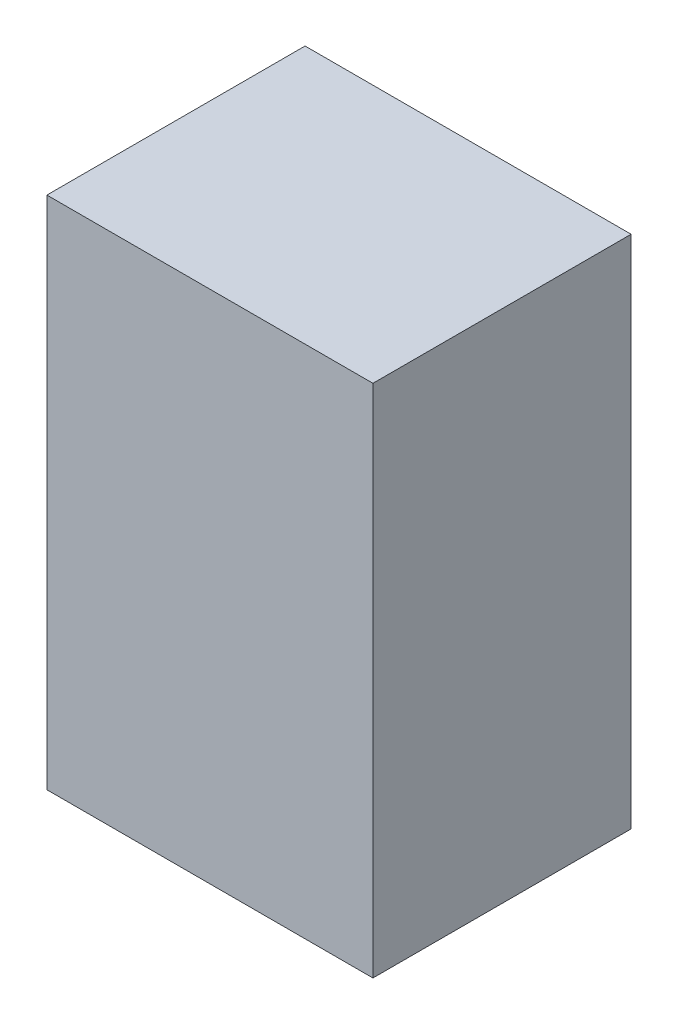
ISO-10303-21;
HEADER;
FILE_DESCRIPTION(('STEP AP214'),'2;1');
FILE_NAME('part.step','',(''),(''),'','','');
FILE_SCHEMA(('AUTOMOTIVE_DESIGN { 1 0 10303 214 1 1 1 1 }'));
ENDSEC;
DATA;
#1=APPLICATION_CONTEXT('core data for automotive mechanical design processes');
#2=APPLICATION_PROTOCOL_DEFINITION('international standard','automotive_design',2000,#1);
#3=PRODUCT_CONTEXT('',#1,'mechanical');
#4=PRODUCT('Part','Part','',(#3));
#5=PRODUCT_RELATED_PRODUCT_CATEGORY('part','',(#4));
#6=PRODUCT_DEFINITION_FORMATION('','',#4);
#7=PRODUCT_DEFINITION_CONTEXT('part definition',#1,'design');
#8=PRODUCT_DEFINITION('design','',#6,#7);
#9=PRODUCT_DEFINITION_SHAPE('','',#8);
#10=(LENGTH_UNIT() NAMED_UNIT(*) SI_UNIT(.MILLI.,.METRE.));
#11=(NAMED_UNIT(*) PLANE_ANGLE_UNIT() SI_UNIT($,.RADIAN.));
#12=(NAMED_UNIT(*) SI_UNIT($,.STERADIAN.) SOLID_ANGLE_UNIT());
#13=UNCERTAINTY_MEASURE_WITH_UNIT(LENGTH_MEASURE(1.E-05),#10,'distance_accuracy_value','');
#14=(GEOMETRIC_REPRESENTATION_CONTEXT(3) GLOBAL_UNCERTAINTY_ASSIGNED_CONTEXT((#13)) GLOBAL_UNIT_ASSIGNED_CONTEXT((#10,
#11,#12)) REPRESENTATION_CONTEXT('',''));
#15=CARTESIAN_POINT('',(0.,0.,0.));
#16=DIRECTION('',(0.,0.,1.));
#17=DIRECTION('',(1.,0.,0.));
#18=AXIS2_PLACEMENT_3D('',#15,#16,#17);
#19=CARTESIAN_POINT('',(-3.60864989540742,-39.8632487144539,-15.3363242388516));
#20=DIRECTION('',(0.,0.,1.));
#21=DIRECTION('',(1.,0.,0.));
#22=AXIS2_PLACEMENT_3D('',#19,#20,#21);
#23=PLANE('',#22);
#24=CARTESIAN_POINT('',(-3.60864989540742,-37.8582195429255,-15.3363242388516));
#25=CARTESIAN_POINT('',(-3.60864989540742,-39.8632487144539,-15.3363242388516));
#26=(BOUNDED_CURVE() B_SPLINE_CURVE(1,(#24,#25),.UNSPECIFIED.,.F.,
.F.) B_SPLINE_CURVE_WITH_KNOTS((2,2),(0.,2.00502917152843),
.UNSPECIFIED.) CURVE() GEOMETRIC_REPRESENTATION_ITEM() RATIONAL_B_SPLINE_CURVE((1.,1.)) REPRESENTATION_ITEM(''));
#27=CARTESIAN_POINT('',(-3.60864989540742,-37.8582195429255,-15.3363242388516));
#28=VERTEX_POINT('',#27);
#29=CARTESIAN_POINT('',(-3.60864989540742,-39.8632487144539,-15.3363242388516));
#30=VERTEX_POINT('',#29);
#31=EDGE_CURVE('E28',#28,#30,#26,.T.);
#32=ORIENTED_EDGE('',*,*,#31,.F.);
#33=CARTESIAN_POINT('',(-4.8779028488027,-37.8582195429255,-15.3363242388516));
#34=CARTESIAN_POINT('',(-3.60864989540742,-37.8582195429255,-15.3363242388516));
#35=(BOUNDED_CURVE() B_SPLINE_CURVE(1,(#33,#34),.UNSPECIFIED.,.F.,
.F.) B_SPLINE_CURVE_WITH_KNOTS((2,2),(0.,1.26925295339528),
.UNSPECIFIED.) CURVE() GEOMETRIC_REPRESENTATION_ITEM() RATIONAL_B_SPLINE_CURVE((1.,1.)) REPRESENTATION_ITEM(''));
#36=CARTESIAN_POINT('',(-4.8779028488027,-37.8582195429255,-15.3363242388516));
#37=VERTEX_POINT('',#36);
#38=EDGE_CURVE('E73',#37,#28,#35,.T.);
#39=ORIENTED_EDGE('',*,*,#38,.F.);
#40=CARTESIAN_POINT('',(-4.8779028488027,-39.8632487144539,-15.3363242388516));
#41=CARTESIAN_POINT('',(-4.8779028488027,-37.8582195429255,-15.3363242388516));
#42=(BOUNDED_CURVE() B_SPLINE_CURVE(1,(#40,#41),.UNSPECIFIED.,.F.,
.F.) B_SPLINE_CURVE_WITH_KNOTS((2,2),(0.,2.00502917152843),
.UNSPECIFIED.) CURVE() GEOMETRIC_REPRESENTATION_ITEM() RATIONAL_B_SPLINE_CURVE((1.,1.)) REPRESENTATION_ITEM(''));
#43=CARTESIAN_POINT('',(-4.8779028488027,-39.8632487144539,-15.3363242388516));
#44=VERTEX_POINT('',#43);
#45=EDGE_CURVE('E67',#44,#37,#42,.T.);
#46=ORIENTED_EDGE('',*,*,#45,.F.);
#47=CARTESIAN_POINT('',(-3.60864989540742,-39.8632487144539,-15.3363242388516));
#48=CARTESIAN_POINT('',(-4.8779028488027,-39.8632487144539,-15.3363242388516));
#49=(BOUNDED_CURVE() B_SPLINE_CURVE(1,(#47,#48),.UNSPECIFIED.,.F.,
.F.) B_SPLINE_CURVE_WITH_KNOTS((2,2),(0.,1.26925295339528),
.UNSPECIFIED.) CURVE() GEOMETRIC_REPRESENTATION_ITEM() RATIONAL_B_SPLINE_CURVE((1.,1.)) REPRESENTATION_ITEM(''));
#50=EDGE_CURVE('E70',#30,#44,#49,.T.);
#51=ORIENTED_EDGE('',*,*,#50,.F.);
#52=EDGE_LOOP('',(#32,#39,#46,#51));
#53=FACE_BOUND('',#52,.T.);
#54=ADVANCED_FACE('F16',(#53),#23,.T.);
#55=CARTESIAN_POINT('',(-3.60864989540742,-39.8632487144539,-16.3414214772802));
#56=DIRECTION('',(0.,0.,-1.));
#57=DIRECTION('',(0.,-1.,0.));
#58=AXIS2_PLACEMENT_3D('',#55,#56,#57);
#59=PLANE('',#58);
#60=CARTESIAN_POINT('',(-3.60864989540742,-39.8632487144539,-16.3414214772802));
#61=CARTESIAN_POINT('',(-4.8779028488027,-39.8632487144539,-16.3414214772802));
#62=(BOUNDED_CURVE() B_SPLINE_CURVE(1,(#60,#61),.UNSPECIFIED.,.F.,
.F.) B_SPLINE_CURVE_WITH_KNOTS((2,2),(0.,1.26925295339528),
.UNSPECIFIED.) CURVE() GEOMETRIC_REPRESENTATION_ITEM() RATIONAL_B_SPLINE_CURVE((1.,1.)) REPRESENTATION_ITEM(''));
#63=CARTESIAN_POINT('',(-3.60864989540742,-39.8632487144539,-16.3414214772802));
#64=VERTEX_POINT('',#63);
#65=CARTESIAN_POINT('',(-4.8779028488027,-39.8632487144539,-16.3414214772802));
#66=VERTEX_POINT('',#65);
#67=EDGE_CURVE('E79',#64,#66,#62,.T.);
#68=ORIENTED_EDGE('',*,*,#67,.T.);
#69=CARTESIAN_POINT('',(-4.8779028488027,-39.8632487144539,-16.3414214772802));
#70=CARTESIAN_POINT('',(-4.8779028488027,-37.8582195429255,-16.3414214772802));
#71=(BOUNDED_CURVE() B_SPLINE_CURVE(1,(#69,#70),.UNSPECIFIED.,.F.,
.F.) B_SPLINE_CURVE_WITH_KNOTS((2,2),(0.,2.00502917152843),
.UNSPECIFIED.) CURVE() GEOMETRIC_REPRESENTATION_ITEM() RATIONAL_B_SPLINE_CURVE((1.,1.)) REPRESENTATION_ITEM(''));
#72=CARTESIAN_POINT('',(-4.8779028488027,-37.8582195429255,-16.3414214772802));
#73=VERTEX_POINT('',#72);
#74=EDGE_CURVE('E84',#66,#73,#71,.T.);
#75=ORIENTED_EDGE('',*,*,#74,.T.);
#76=CARTESIAN_POINT('',(-4.8779028488027,-37.8582195429255,-16.3414214772802));
#77=CARTESIAN_POINT('',(-3.60864989540742,-37.8582195429255,-16.3414214772802));
#78=(BOUNDED_CURVE() B_SPLINE_CURVE(1,(#76,#77),.UNSPECIFIED.,.F.,
.F.) B_SPLINE_CURVE_WITH_KNOTS((2,2),(0.,1.26925295339528),
.UNSPECIFIED.) CURVE() GEOMETRIC_REPRESENTATION_ITEM() RATIONAL_B_SPLINE_CURVE((1.,1.)) REPRESENTATION_ITEM(''));
#79=CARTESIAN_POINT('',(-3.60864989540742,-37.8582195429255,-16.3414214772802));
#80=VERTEX_POINT('',#79);
#81=EDGE_CURVE('E124',#73,#80,#78,.T.);
#82=ORIENTED_EDGE('',*,*,#81,.T.);
#83=CARTESIAN_POINT('',(-3.60864989540742,-37.8582195429255,-16.3414214772802));
#84=CARTESIAN_POINT('',(-3.60864989540742,-39.8632487144539,-16.3414214772802));
#85=(BOUNDED_CURVE() B_SPLINE_CURVE(1,(#83,#84),.UNSPECIFIED.,.F.,
.F.) B_SPLINE_CURVE_WITH_KNOTS((2,2),(0.,2.00502917152843),
.UNSPECIFIED.) CURVE() GEOMETRIC_REPRESENTATION_ITEM() RATIONAL_B_SPLINE_CURVE((1.,1.)) REPRESENTATION_ITEM(''));
#86=EDGE_CURVE('E11',#80,#64,#85,.T.);
#87=ORIENTED_EDGE('',*,*,#86,.T.);
#88=EDGE_LOOP('',(#68,#75,#82,#87));
#89=FACE_BOUND('',#88,.T.);
#90=ADVANCED_FACE('F219',(#89),#59,.T.);
#91=CARTESIAN_POINT('',(-3.60864989540742,-37.8582195429255,-16.3414214772802));
#92=DIRECTION('',(1.,0.,0.));
#93=DIRECTION('',(0.,1.,0.));
#94=AXIS2_PLACEMENT_3D('',#91,#92,#93);
#95=PLANE('',#94);
#96=CARTESIAN_POINT('',(-3.60864989540742,-37.8582195429255,-16.3414214772802));
#97=CARTESIAN_POINT('',(-3.60864989540742,-37.8582195429255,-15.3363242388516));
#98=(BOUNDED_CURVE() B_SPLINE_CURVE(1,(#96,#97),.UNSPECIFIED.,.F.,
.F.) B_SPLINE_CURVE_WITH_KNOTS((2,2),(0.,1.00509723842863),
.UNSPECIFIED.) CURVE() GEOMETRIC_REPRESENTATION_ITEM() RATIONAL_B_SPLINE_CURVE((1.,1.)) REPRESENTATION_ITEM(''));
#99=EDGE_CURVE('E117',#80,#28,#98,.T.);
#100=ORIENTED_EDGE('',*,*,#99,.T.);
#101=ORIENTED_EDGE('',*,*,#31,.T.);
#102=CARTESIAN_POINT('',(-3.60864989540742,-39.8632487144539,-16.3414214772802));
#103=CARTESIAN_POINT('',(-3.60864989540742,-39.8632487144539,-15.3363242388516));
#104=(BOUNDED_CURVE() B_SPLINE_CURVE(1,(#102,#103),.UNSPECIFIED.,.F.,
.F.) B_SPLINE_CURVE_WITH_KNOTS((2,2),(0.,1.00509723842863),
.UNSPECIFIED.) CURVE() GEOMETRIC_REPRESENTATION_ITEM() RATIONAL_B_SPLINE_CURVE((1.,1.)) REPRESENTATION_ITEM(''));
#105=EDGE_CURVE('E91',#64,#30,#104,.T.);
#106=ORIENTED_EDGE('',*,*,#105,.F.);
#107=ORIENTED_EDGE('',*,*,#86,.F.);
#108=EDGE_LOOP('',(#100,#101,#106,#107));
#109=FACE_BOUND('',#108,.T.);
#110=ADVANCED_FACE('F159',(#109),#95,.T.);
#111=CARTESIAN_POINT('',(-4.8779028488027,-37.8582195429255,-16.3414214772802));
#112=DIRECTION('',(0.,1.,0.));
#113=DIRECTION('',(1.,0.,0.));
#114=AXIS2_PLACEMENT_3D('',#111,#112,#113);
#115=PLANE('',#114);
#116=CARTESIAN_POINT('',(-4.8779028488027,-37.8582195429255,-16.3414214772802));
#117=CARTESIAN_POINT('',(-4.8779028488027,-37.8582195429255,-15.3363242388516));
#118=(BOUNDED_CURVE() B_SPLINE_CURVE(1,(#116,#117),.UNSPECIFIED.,.F.,
.F.) B_SPLINE_CURVE_WITH_KNOTS((2,2),(0.,1.00509723842863),
.UNSPECIFIED.) CURVE() GEOMETRIC_REPRESENTATION_ITEM() RATIONAL_B_SPLINE_CURVE((1.,1.)) REPRESENTATION_ITEM(''));
#119=EDGE_CURVE('E78',#73,#37,#118,.T.);
#120=ORIENTED_EDGE('',*,*,#119,.T.);
#121=ORIENTED_EDGE('',*,*,#38,.T.);
#122=ORIENTED_EDGE('',*,*,#99,.F.);
#123=ORIENTED_EDGE('',*,*,#81,.F.);
#124=EDGE_LOOP('',(#120,#121,#122,#123));
#125=FACE_BOUND('',#124,.T.);
#126=ADVANCED_FACE('F162',(#125),#115,.T.);
#127=CARTESIAN_POINT('',(-4.8779028488027,-39.8632487144539,-16.3414214772802));
#128=DIRECTION('',(-1.,0.,0.));
#129=DIRECTION('',(0.,0.,1.));
#130=AXIS2_PLACEMENT_3D('',#127,#128,#129);
#131=PLANE('',#130);
#132=CARTESIAN_POINT('',(-4.8779028488027,-39.8632487144539,-16.3414214772802));
#133=CARTESIAN_POINT('',(-4.8779028488027,-39.8632487144539,-15.3363242388516));
#134=(BOUNDED_CURVE() B_SPLINE_CURVE(1,(#132,#133),.UNSPECIFIED.,.F.,
.F.) B_SPLINE_CURVE_WITH_KNOTS((2,2),(0.,1.00509723842863),
.UNSPECIFIED.) CURVE() GEOMETRIC_REPRESENTATION_ITEM() RATIONAL_B_SPLINE_CURVE((1.,1.)) REPRESENTATION_ITEM(''));
#135=EDGE_CURVE('E82',#66,#44,#134,.T.);
#136=ORIENTED_EDGE('',*,*,#135,.T.);
#137=ORIENTED_EDGE('',*,*,#45,.T.);
#138=ORIENTED_EDGE('',*,*,#119,.F.);
#139=ORIENTED_EDGE('',*,*,#74,.F.);
#140=EDGE_LOOP('',(#136,#137,#138,#139));
#141=FACE_BOUND('',#140,.T.);
#142=ADVANCED_FACE('F18',(#141),#131,.T.);
#143=CARTESIAN_POINT('',(-3.60864989540742,-39.8632487144539,-16.3414214772802));
#144=DIRECTION('',(0.,-1.,0.));
#145=DIRECTION('',(0.,0.,-1.));
#146=AXIS2_PLACEMENT_3D('',#143,#144,#145);
#147=PLANE('',#146);
#148=ORIENTED_EDGE('',*,*,#105,.T.);
#149=ORIENTED_EDGE('',*,*,#50,.T.);
#150=ORIENTED_EDGE('',*,*,#135,.F.);
#151=ORIENTED_EDGE('',*,*,#67,.F.);
#152=EDGE_LOOP('',(#148,#149,#150,#151));
#153=FACE_BOUND('',#152,.T.);
#154=ADVANCED_FACE('F90',(#153),#147,.T.);
#155=CLOSED_SHELL('',(#54,#90,#110,#126,#142,#154));
#156=MANIFOLD_SOLID_BREP('B1',#155);
#157=ADVANCED_BREP_SHAPE_REPRESENTATION('',(#18,#156),#14);
#158=SHAPE_DEFINITION_REPRESENTATION(#9,#157);
ENDSEC;
END-ISO-10303-21;
